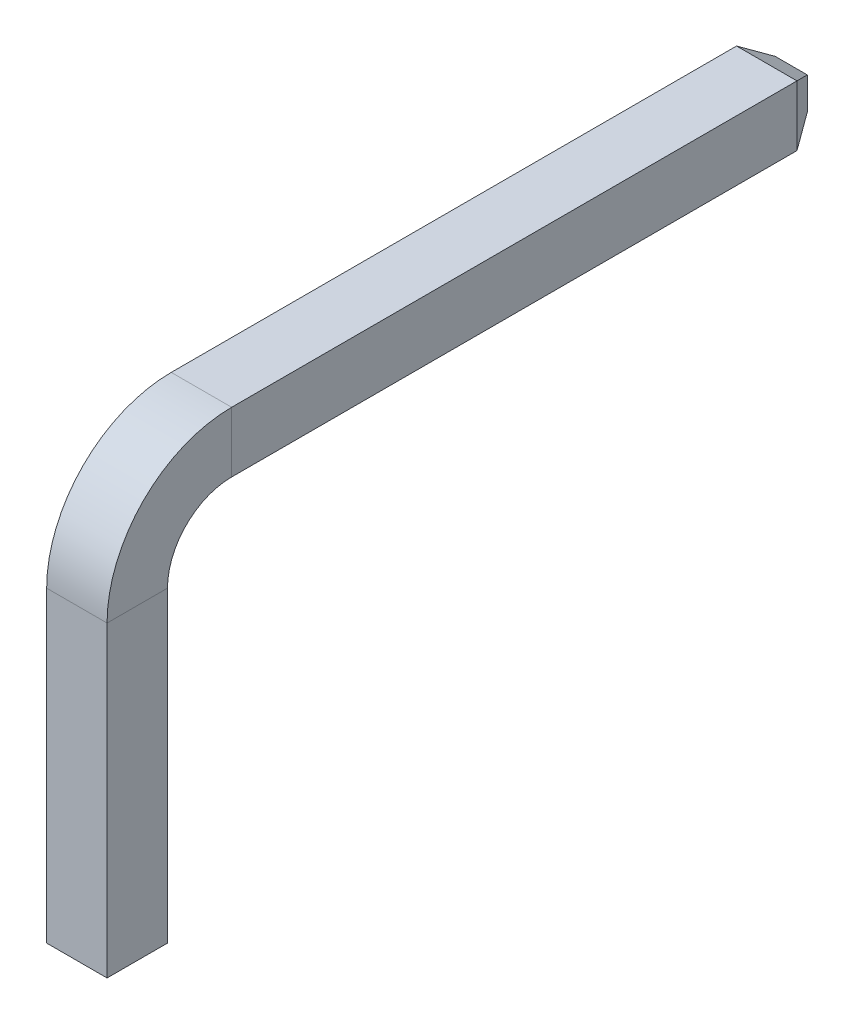
ISO-10303-21;
HEADER;
FILE_DESCRIPTION(('STEP AP214'),'2;1');
FILE_NAME('part.step','',(''),(''),'','','');
FILE_SCHEMA(('AUTOMOTIVE_DESIGN { 1 0 10303 214 1 1 1 1 }'));
ENDSEC;
DATA;
#1=APPLICATION_CONTEXT('core data for automotive mechanical design processes');
#2=APPLICATION_PROTOCOL_DEFINITION('international standard','automotive_design',2000,#1);
#3=PRODUCT_CONTEXT('',#1,'mechanical');
#4=PRODUCT('Part','Part','',(#3));
#5=PRODUCT_RELATED_PRODUCT_CATEGORY('part','',(#4));
#6=PRODUCT_DEFINITION_FORMATION('','',#4);
#7=PRODUCT_DEFINITION_CONTEXT('part definition',#1,'design');
#8=PRODUCT_DEFINITION('design','',#6,#7);
#9=PRODUCT_DEFINITION_SHAPE('','',#8);
#10=(LENGTH_UNIT() NAMED_UNIT(*) SI_UNIT(.MILLI.,.METRE.));
#11=(NAMED_UNIT(*) PLANE_ANGLE_UNIT() SI_UNIT($,.RADIAN.));
#12=(NAMED_UNIT(*) SI_UNIT($,.STERADIAN.) SOLID_ANGLE_UNIT());
#13=UNCERTAINTY_MEASURE_WITH_UNIT(LENGTH_MEASURE(1.E-05),#10,'distance_accuracy_value','');
#14=(GEOMETRIC_REPRESENTATION_CONTEXT(3) GLOBAL_UNCERTAINTY_ASSIGNED_CONTEXT((#13)) GLOBAL_UNIT_ASSIGNED_CONTEXT((#10,
#11,#12)) REPRESENTATION_CONTEXT('',''));
#15=CARTESIAN_POINT('',(0.,0.,0.));
#16=DIRECTION('',(0.,0.,1.));
#17=DIRECTION('',(1.,0.,0.));
#18=AXIS2_PLACEMENT_3D('',#15,#16,#17);
#19=CARTESIAN_POINT('',(0.,5.75,-7.25));
#20=DIRECTION('',(0.,0.,1.));
#21=DIRECTION('',(0.,-1.,0.));
#22=AXIS2_PLACEMENT_3D('',#19,#20,#21);
#23=PLANE('',#22);
#24=DIRECTION('',(0.,1.,0.));
#25=VECTOR('',#24,1.);
#26=CARTESIAN_POINT('',(-0.169999999999999,5.75,-7.25));
#27=LINE('',#26,#25);
#28=CARTESIAN_POINT('',(-0.169999999999999,5.58,-7.25));
#29=VERTEX_POINT('',#28);
#30=CARTESIAN_POINT('',(-0.169999999999999,5.92,-7.25));
#31=VERTEX_POINT('',#30);
#32=EDGE_CURVE('E149',#29,#31,#27,.T.);
#33=ORIENTED_EDGE('',*,*,#32,.T.);
#34=DIRECTION('',(1.,0.,0.));
#35=VECTOR('',#34,1.);
#36=CARTESIAN_POINT('',(0.,5.92,-7.25));
#37=LINE('',#36,#35);
#38=CARTESIAN_POINT('',(0.169999999999999,5.92,-7.25));
#39=VERTEX_POINT('',#38);
#40=EDGE_CURVE('E151',#31,#39,#37,.T.);
#41=ORIENTED_EDGE('',*,*,#40,.T.);
#42=DIRECTION('',(0.,-1.,0.));
#43=VECTOR('',#42,1.);
#44=CARTESIAN_POINT('',(0.169999999999999,5.75,-7.25));
#45=LINE('',#44,#43);
#46=CARTESIAN_POINT('',(0.169999999999999,5.58,-7.25));
#47=VERTEX_POINT('',#46);
#48=EDGE_CURVE('E131',#39,#47,#45,.T.);
#49=ORIENTED_EDGE('',*,*,#48,.T.);
#50=DIRECTION('',(-1.,0.,0.));
#51=VECTOR('',#50,1.);
#52=CARTESIAN_POINT('',(0.,5.58,-7.25));
#53=LINE('',#52,#51);
#54=EDGE_CURVE('E133',#47,#29,#53,.T.);
#55=ORIENTED_EDGE('',*,*,#54,.T.);
#56=EDGE_LOOP('',(#33,#41,#49,#55));
#57=FACE_BOUND('',#56,.T.);
#58=ADVANCED_FACE('F34',(#57),#23,.F.);
#59=CARTESIAN_POINT('',(0.32,6.07,-7.25));
#60=DIRECTION('',(-1.,0.,0.));
#61=DIRECTION('',(0.,0.,1.));
#62=AXIS2_PLACEMENT_3D('',#59,#60,#61);
#63=PLANE('',#62);
#64=DIRECTION('',(0.,0.,1.));
#65=VECTOR('',#64,1.);
#66=CARTESIAN_POINT('',(0.32,5.43,-7.25));
#67=LINE('',#66,#65);
#68=CARTESIAN_POINT('',(0.32,5.43,-6.99019237886467));
#69=VERTEX_POINT('',#68);
#70=CARTESIAN_POINT('',(0.32,5.43,-1.));
#71=VERTEX_POINT('',#70);
#72=EDGE_CURVE('E181',#69,#71,#67,.T.);
#73=ORIENTED_EDGE('',*,*,#72,.F.);
#74=DIRECTION('',(0.,1.,0.));
#75=VECTOR('',#74,1.);
#76=CARTESIAN_POINT('',(0.32,6.07,-6.99019237886467));
#77=LINE('',#76,#75);
#78=CARTESIAN_POINT('',(0.32,6.07,-6.99019237886467));
#79=VERTEX_POINT('',#78);
#80=EDGE_CURVE('E11',#69,#79,#77,.T.);
#81=ORIENTED_EDGE('',*,*,#80,.T.);
#82=DIRECTION('',(0.,0.,1.));
#83=VECTOR('',#82,1.);
#84=CARTESIAN_POINT('',(0.32,6.07,-7.25));
#85=LINE('',#84,#83);
#86=CARTESIAN_POINT('',(0.32,6.07,-1.));
#87=VERTEX_POINT('',#86);
#88=EDGE_CURVE('E170',#79,#87,#85,.T.);
#89=ORIENTED_EDGE('',*,*,#88,.T.);
#90=DIRECTION('',(0.,-1.,0.));
#91=VECTOR('',#90,1.);
#92=CARTESIAN_POINT('',(0.32,6.07,-1.));
#93=LINE('',#92,#91);
#94=EDGE_CURVE('E175',#87,#71,#93,.T.);
#95=ORIENTED_EDGE('',*,*,#94,.T.);
#96=EDGE_LOOP('',(#73,#81,#89,#95));
#97=FACE_BOUND('',#96,.T.);
#98=ADVANCED_FACE('F229',(#97),#63,.F.);
#99=CARTESIAN_POINT('',(-0.32,5.43,-7.25));
#100=DIRECTION('',(0.,1.,0.));
#101=DIRECTION('',(0.,0.,1.));
#102=AXIS2_PLACEMENT_3D('',#99,#100,#101);
#103=PLANE('',#102);
#104=DIRECTION('',(0.,0.,1.));
#105=VECTOR('',#104,1.);
#106=CARTESIAN_POINT('',(-0.32,5.43,-7.25));
#107=LINE('',#106,#105);
#108=CARTESIAN_POINT('',(-0.32,5.43,-6.99019237886467));
#109=VERTEX_POINT('',#108);
#110=CARTESIAN_POINT('',(-0.32,5.43,-1.));
#111=VERTEX_POINT('',#110);
#112=EDGE_CURVE('E200',#109,#111,#107,.T.);
#113=ORIENTED_EDGE('',*,*,#112,.F.);
#114=DIRECTION('',(1.,0.,0.));
#115=VECTOR('',#114,1.);
#116=CARTESIAN_POINT('',(-0.32,5.43,-6.99019237886467));
#117=LINE('',#116,#115);
#118=EDGE_CURVE('E43',#109,#69,#117,.T.);
#119=ORIENTED_EDGE('',*,*,#118,.T.);
#120=ORIENTED_EDGE('',*,*,#72,.T.);
#121=DIRECTION('',(-1.,0.,0.));
#122=VECTOR('',#121,1.);
#123=CARTESIAN_POINT('',(-0.32,5.43,-1.));
#124=LINE('',#123,#122);
#125=EDGE_CURVE('E197',#71,#111,#124,.T.);
#126=ORIENTED_EDGE('',*,*,#125,.T.);
#127=EDGE_LOOP('',(#113,#119,#120,#126));
#128=FACE_BOUND('',#127,.T.);
#129=ADVANCED_FACE('F224',(#128),#103,.F.);
#130=CARTESIAN_POINT('',(-0.32,6.07,-7.25));
#131=DIRECTION('',(1.,0.,0.));
#132=DIRECTION('',(0.,0.,-1.));
#133=AXIS2_PLACEMENT_3D('',#130,#131,#132);
#134=PLANE('',#133);
#135=DIRECTION('',(0.,0.,1.));
#136=VECTOR('',#135,1.);
#137=CARTESIAN_POINT('',(-0.32,6.07,-7.25));
#138=LINE('',#137,#136);
#139=CARTESIAN_POINT('',(-0.32,6.07,-6.99019237886467));
#140=VERTEX_POINT('',#139);
#141=CARTESIAN_POINT('',(-0.32,6.07,-1.));
#142=VERTEX_POINT('',#141);
#143=EDGE_CURVE('E145',#140,#142,#138,.T.);
#144=ORIENTED_EDGE('',*,*,#143,.F.);
#145=DIRECTION('',(0.,-1.,0.));
#146=VECTOR('',#145,1.);
#147=CARTESIAN_POINT('',(-0.32,6.07,-6.99019237886467));
#148=LINE('',#147,#146);
#149=EDGE_CURVE('E157',#140,#109,#148,.T.);
#150=ORIENTED_EDGE('',*,*,#149,.T.);
#151=ORIENTED_EDGE('',*,*,#112,.T.);
#152=DIRECTION('',(0.,1.,0.));
#153=VECTOR('',#152,1.);
#154=CARTESIAN_POINT('',(-0.32,6.07,-1.));
#155=LINE('',#154,#153);
#156=EDGE_CURVE('E202',#111,#142,#155,.T.);
#157=ORIENTED_EDGE('',*,*,#156,.T.);
#158=EDGE_LOOP('',(#144,#150,#151,#157));
#159=FACE_BOUND('',#158,.T.);
#160=ADVANCED_FACE('F340',(#159),#134,.F.);
#161=CARTESIAN_POINT('',(-0.32,6.07,-7.25));
#162=DIRECTION('',(0.,-1.,0.));
#163=DIRECTION('',(0.,0.,-1.));
#164=AXIS2_PLACEMENT_3D('',#161,#162,#163);
#165=PLANE('',#164);
#166=ORIENTED_EDGE('',*,*,#88,.F.);
#167=DIRECTION('',(-1.,0.,0.));
#168=VECTOR('',#167,1.);
#169=CARTESIAN_POINT('',(-0.32,6.07,-6.99019237886467));
#170=LINE('',#169,#168);
#171=EDGE_CURVE('E154',#79,#140,#170,.T.);
#172=ORIENTED_EDGE('',*,*,#171,.T.);
#173=ORIENTED_EDGE('',*,*,#143,.T.);
#174=DIRECTION('',(1.,0.,0.));
#175=VECTOR('',#174,1.);
#176=CARTESIAN_POINT('',(-0.32,6.07,-1.));
#177=LINE('',#176,#175);
#178=EDGE_CURVE('E141',#142,#87,#177,.T.);
#179=ORIENTED_EDGE('',*,*,#178,.T.);
#180=EDGE_LOOP('',(#166,#172,#173,#179));
#181=FACE_BOUND('',#180,.T.);
#182=ADVANCED_FACE('F333',(#181),#165,.F.);
#183=CARTESIAN_POINT('',(0.32,6.07,-1.));
#184=DIRECTION('',(-1.,0.,0.));
#185=DIRECTION('',(0.,0.,1.));
#186=AXIS2_PLACEMENT_3D('',#183,#184,#185);
#187=PLANE('',#186);
#188=CARTESIAN_POINT('',(0.32,4.75,-1.));
#189=DIRECTION('',(1.,0.,0.));
#190=DIRECTION('',(0.,1.,0.));
#191=AXIS2_PLACEMENT_3D('',#188,#189,#190);
#192=CIRCLE('',#191,0.68);
#193=CARTESIAN_POINT('',(0.32,4.75,-0.32));
#194=VERTEX_POINT('',#193);
#195=EDGE_CURVE('E188',#71,#194,#192,.T.);
#196=ORIENTED_EDGE('',*,*,#195,.F.);
#197=ORIENTED_EDGE('',*,*,#94,.F.);
#198=CARTESIAN_POINT('',(0.32,4.75,-1.));
#199=DIRECTION('',(1.,0.,0.));
#200=DIRECTION('',(0.,1.,0.));
#201=AXIS2_PLACEMENT_3D('',#198,#199,#200);
#202=CIRCLE('',#201,1.32);
#203=CARTESIAN_POINT('',(0.32,4.75,0.32));
#204=VERTEX_POINT('',#203);
#205=EDGE_CURVE('E144',#87,#204,#202,.T.);
#206=ORIENTED_EDGE('',*,*,#205,.T.);
#207=DIRECTION('',(0.,0.,-1.));
#208=VECTOR('',#207,1.);
#209=CARTESIAN_POINT('',(0.32,4.75,0.32));
#210=LINE('',#209,#208);
#211=EDGE_CURVE('E185',#204,#194,#210,.T.);
#212=ORIENTED_EDGE('',*,*,#211,.T.);
#213=EDGE_LOOP('',(#196,#197,#206,#212));
#214=FACE_BOUND('',#213,.T.);
#215=ADVANCED_FACE('F231',(#214),#187,.F.);
#216=CARTESIAN_POINT('',(0.,4.75,-1.));
#217=DIRECTION('',(1.,0.,0.));
#218=DIRECTION('',(0.,0.,-1.));
#219=AXIS2_PLACEMENT_3D('',#216,#217,#218);
#220=CYLINDRICAL_SURFACE('',#219,0.68);
#221=CARTESIAN_POINT('',(-0.32,4.75,-1.));
#222=DIRECTION('',(1.,0.,0.));
#223=DIRECTION('',(0.,1.,0.));
#224=AXIS2_PLACEMENT_3D('',#221,#222,#223);
#225=CIRCLE('',#224,0.68);
#226=CARTESIAN_POINT('',(-0.32,4.75,-0.32));
#227=VERTEX_POINT('',#226);
#228=EDGE_CURVE('E205',#111,#227,#225,.T.);
#229=ORIENTED_EDGE('',*,*,#228,.F.);
#230=ORIENTED_EDGE('',*,*,#125,.F.);
#231=ORIENTED_EDGE('',*,*,#195,.T.);
#232=DIRECTION('',(-1.,0.,0.));
#233=VECTOR('',#232,1.);
#234=CARTESIAN_POINT('',(-0.32,4.75,-0.32));
#235=LINE('',#234,#233);
#236=EDGE_CURVE('E191',#194,#227,#235,.T.);
#237=ORIENTED_EDGE('',*,*,#236,.T.);
#238=EDGE_LOOP('',(#229,#230,#231,#237));
#239=FACE_BOUND('',#238,.T.);
#240=ADVANCED_FACE('F227',(#239),#220,.F.);
#241=CARTESIAN_POINT('',(-0.32,6.07,-1.));
#242=DIRECTION('',(1.,0.,0.));
#243=DIRECTION('',(0.,0.,-1.));
#244=AXIS2_PLACEMENT_3D('',#241,#242,#243);
#245=PLANE('',#244);
#246=CARTESIAN_POINT('',(-0.32,4.75,-1.));
#247=DIRECTION('',(1.,0.,0.));
#248=DIRECTION('',(0.,1.,0.));
#249=AXIS2_PLACEMENT_3D('',#246,#247,#248);
#250=CIRCLE('',#249,1.32);
#251=CARTESIAN_POINT('',(-0.32,4.75,0.32));
#252=VERTEX_POINT('',#251);
#253=EDGE_CURVE('E139',#142,#252,#250,.T.);
#254=ORIENTED_EDGE('',*,*,#253,.F.);
#255=ORIENTED_EDGE('',*,*,#156,.F.);
#256=ORIENTED_EDGE('',*,*,#228,.T.);
#257=DIRECTION('',(0.,0.,1.));
#258=VECTOR('',#257,1.);
#259=CARTESIAN_POINT('',(-0.32,4.75,0.32));
#260=LINE('',#259,#258);
#261=EDGE_CURVE('E207',#227,#252,#260,.T.);
#262=ORIENTED_EDGE('',*,*,#261,.T.);
#263=EDGE_LOOP('',(#254,#255,#256,#262));
#264=FACE_BOUND('',#263,.T.);
#265=ADVANCED_FACE('F219',(#264),#245,.F.);
#266=CARTESIAN_POINT('',(0.,4.75,-1.));
#267=DIRECTION('',(1.,0.,0.));
#268=DIRECTION('',(0.,0.,-1.));
#269=AXIS2_PLACEMENT_3D('',#266,#267,#268);
#270=CYLINDRICAL_SURFACE('',#269,1.32);
#271=DIRECTION('',(1.,0.,0.));
#272=VECTOR('',#271,1.);
#273=CARTESIAN_POINT('',(-0.32,4.75,0.32));
#274=LINE('',#273,#272);
#275=EDGE_CURVE('E129',#252,#204,#274,.T.);
#276=ORIENTED_EDGE('',*,*,#275,.T.);
#277=ORIENTED_EDGE('',*,*,#205,.F.);
#278=ORIENTED_EDGE('',*,*,#178,.F.);
#279=ORIENTED_EDGE('',*,*,#253,.T.);
#280=EDGE_LOOP('',(#276,#277,#278,#279));
#281=FACE_BOUND('',#280,.T.);
#282=ADVANCED_FACE('F216',(#281),#270,.T.);
#283=CARTESIAN_POINT('',(0.32,4.75,0.32));
#284=DIRECTION('',(-1.,0.,0.));
#285=DIRECTION('',(0.,0.,1.));
#286=AXIS2_PLACEMENT_3D('',#283,#284,#285);
#287=PLANE('',#286);
#288=DIRECTION('',(0.,-1.,0.));
#289=VECTOR('',#288,1.);
#290=CARTESIAN_POINT('',(0.32,4.75,0.32));
#291=LINE('',#290,#289);
#292=CARTESIAN_POINT('',(0.32,1.49278538498976,0.32));
#293=VERTEX_POINT('',#292);
#294=EDGE_CURVE('E146',#204,#293,#291,.T.);
#295=ORIENTED_EDGE('',*,*,#294,.T.);
#296=DIRECTION('',(0.,0.,1.));
#297=VECTOR('',#296,1.);
#298=CARTESIAN_POINT('',(0.32,1.49278538498976,-7.25));
#299=LINE('',#298,#297);
#300=CARTESIAN_POINT('',(0.32,1.49278538498976,-0.32));
#301=VERTEX_POINT('',#300);
#302=EDGE_CURVE('E51',#301,#293,#299,.T.);
#303=ORIENTED_EDGE('',*,*,#302,.F.);
#304=DIRECTION('',(0.,-1.,0.));
#305=VECTOR('',#304,1.);
#306=CARTESIAN_POINT('',(0.32,4.75,-0.32));
#307=LINE('',#306,#305);
#308=EDGE_CURVE('E135',#194,#301,#307,.T.);
#309=ORIENTED_EDGE('',*,*,#308,.F.);
#310=ORIENTED_EDGE('',*,*,#211,.F.);
#311=EDGE_LOOP('',(#295,#303,#309,#310));
#312=FACE_BOUND('',#311,.T.);
#313=ADVANCED_FACE('F233',(#312),#287,.F.);
#314=CARTESIAN_POINT('',(-0.32,4.75,-0.32));
#315=DIRECTION('',(0.,0.,1.));
#316=DIRECTION('',(1.,0.,0.));
#317=AXIS2_PLACEMENT_3D('',#314,#315,#316);
#318=PLANE('',#317);
#319=ORIENTED_EDGE('',*,*,#308,.T.);
#320=DIRECTION('',(-1.,0.,0.));
#321=VECTOR('',#320,1.);
#322=CARTESIAN_POINT('',(-0.32,1.49278538498976,-0.32));
#323=LINE('',#322,#321);
#324=CARTESIAN_POINT('',(-0.32,1.49278538498976,-0.32));
#325=VERTEX_POINT('',#324);
#326=EDGE_CURVE('E125',#301,#325,#323,.T.);
#327=ORIENTED_EDGE('',*,*,#326,.T.);
#328=DIRECTION('',(0.,-1.,0.));
#329=VECTOR('',#328,1.);
#330=CARTESIAN_POINT('',(-0.32,4.75,-0.32));
#331=LINE('',#330,#329);
#332=EDGE_CURVE('E124',#227,#325,#331,.T.);
#333=ORIENTED_EDGE('',*,*,#332,.F.);
#334=ORIENTED_EDGE('',*,*,#236,.F.);
#335=EDGE_LOOP('',(#319,#327,#333,#334));
#336=FACE_BOUND('',#335,.T.);
#337=ADVANCED_FACE('F236',(#336),#318,.F.);
#338=CARTESIAN_POINT('',(-0.32,4.75,0.32));
#339=DIRECTION('',(1.,0.,0.));
#340=DIRECTION('',(0.,0.,-1.));
#341=AXIS2_PLACEMENT_3D('',#338,#339,#340);
#342=PLANE('',#341);
#343=ORIENTED_EDGE('',*,*,#332,.T.);
#344=DIRECTION('',(0.,0.,1.));
#345=VECTOR('',#344,1.);
#346=CARTESIAN_POINT('',(-0.32,1.49278538498976,-7.25));
#347=LINE('',#346,#345);
#348=CARTESIAN_POINT('',(-0.32,1.49278538498976,0.32));
#349=VERTEX_POINT('',#348);
#350=EDGE_CURVE('E112',#325,#349,#347,.T.);
#351=ORIENTED_EDGE('',*,*,#350,.T.);
#352=DIRECTION('',(0.,-1.,0.));
#353=VECTOR('',#352,1.);
#354=CARTESIAN_POINT('',(-0.32,4.75,0.32));
#355=LINE('',#354,#353);
#356=EDGE_CURVE('E122',#252,#349,#355,.T.);
#357=ORIENTED_EDGE('',*,*,#356,.F.);
#358=ORIENTED_EDGE('',*,*,#261,.F.);
#359=EDGE_LOOP('',(#343,#351,#357,#358));
#360=FACE_BOUND('',#359,.T.);
#361=ADVANCED_FACE('F120',(#360),#342,.F.);
#362=CARTESIAN_POINT('',(-0.32,4.75,0.32));
#363=DIRECTION('',(0.,0.,-1.));
#364=DIRECTION('',(-1.,0.,0.));
#365=AXIS2_PLACEMENT_3D('',#362,#363,#364);
#366=PLANE('',#365);
#367=ORIENTED_EDGE('',*,*,#356,.T.);
#368=DIRECTION('',(-1.,0.,0.));
#369=VECTOR('',#368,1.);
#370=CARTESIAN_POINT('',(-0.32,1.49278538498976,0.32));
#371=LINE('',#370,#369);
#372=EDGE_CURVE('E109',#293,#349,#371,.T.);
#373=ORIENTED_EDGE('',*,*,#372,.F.);
#374=ORIENTED_EDGE('',*,*,#294,.F.);
#375=ORIENTED_EDGE('',*,*,#275,.F.);
#376=EDGE_LOOP('',(#367,#373,#374,#375));
#377=FACE_BOUND('',#376,.T.);
#378=ADVANCED_FACE('F127',(#377),#366,.F.);
#379=CARTESIAN_POINT('',(0.,5.58,-7.25));
#380=DIRECTION('',(0.,0.866025403784436,0.500000000000005));
#381=DIRECTION('',(-1.,0.,0.));
#382=AXIS2_PLACEMENT_3D('',#379,#380,#381);
#383=PLANE('',#382);
#384=DIRECTION('',(-0.447213595499961,0.447213595499961,-0.77459666924148));
#385=VECTOR('',#384,1.);
#386=CARTESIAN_POINT('',(0.135999999999999,5.614,-7.30888972745734));
#387=LINE('',#386,#385);
#388=EDGE_CURVE('E163',#69,#47,#387,.T.);
#389=ORIENTED_EDGE('',*,*,#388,.F.);
#390=ORIENTED_EDGE('',*,*,#118,.F.);
#391=DIRECTION('',(0.447213595499961,0.447213595499961,-0.77459666924148));
#392=VECTOR('',#391,1.);
#393=CARTESIAN_POINT('',(-0.135999999999999,5.614,-7.30888972745734));
#394=LINE('',#393,#392);
#395=EDGE_CURVE('E38',#29,#109,#394,.F.);
#396=ORIENTED_EDGE('',*,*,#395,.F.);
#397=ORIENTED_EDGE('',*,*,#54,.F.);
#398=EDGE_LOOP('',(#389,#390,#396,#397));
#399=FACE_BOUND('',#398,.T.);
#400=ADVANCED_FACE('F36',(#399),#383,.F.);
#401=CARTESIAN_POINT('',(-0.169999999999999,5.75,-7.25));
#402=DIRECTION('',(0.866025403784436,0.,0.500000000000005));
#403=DIRECTION('',(0.,1.,0.));
#404=AXIS2_PLACEMENT_3D('',#401,#402,#403);
#405=PLANE('',#404);
#406=ORIENTED_EDGE('',*,*,#395,.T.);
#407=ORIENTED_EDGE('',*,*,#149,.F.);
#408=DIRECTION('',(0.447213595499961,-0.447213595499961,-0.77459666924148));
#409=VECTOR('',#408,1.);
#410=CARTESIAN_POINT('',(-0.135999999999999,5.886,-7.30888972745734));
#411=LINE('',#410,#409);
#412=EDGE_CURVE('E162',#31,#140,#411,.F.);
#413=ORIENTED_EDGE('',*,*,#412,.F.);
#414=ORIENTED_EDGE('',*,*,#32,.F.);
#415=EDGE_LOOP('',(#406,#407,#413,#414));
#416=FACE_BOUND('',#415,.T.);
#417=ADVANCED_FACE('F254',(#416),#405,.F.);
#418=CARTESIAN_POINT('',(0.169999999999999,5.75,-7.25));
#419=DIRECTION('',(-0.866025403784436,0.,0.500000000000005));
#420=DIRECTION('',(0.,-1.,0.));
#421=AXIS2_PLACEMENT_3D('',#418,#419,#420);
#422=PLANE('',#421);
#423=ORIENTED_EDGE('',*,*,#388,.T.);
#424=ORIENTED_EDGE('',*,*,#48,.F.);
#425=DIRECTION('',(0.447213595499961,0.447213595499961,0.77459666924148));
#426=VECTOR('',#425,1.);
#427=CARTESIAN_POINT('',(0.135999999999999,5.886,-7.30888972745734));
#428=LINE('',#427,#426);
#429=EDGE_CURVE('E160',#79,#39,#428,.F.);
#430=ORIENTED_EDGE('',*,*,#429,.F.);
#431=ORIENTED_EDGE('',*,*,#80,.F.);
#432=EDGE_LOOP('',(#423,#424,#430,#431));
#433=FACE_BOUND('',#432,.T.);
#434=ADVANCED_FACE('F265',(#433),#422,.F.);
#435=CARTESIAN_POINT('',(0.,5.92,-7.25));
#436=DIRECTION('',(0.,-0.866025403784436,0.500000000000005));
#437=DIRECTION('',(1.,0.,0.));
#438=AXIS2_PLACEMENT_3D('',#435,#436,#437);
#439=PLANE('',#438);
#440=ORIENTED_EDGE('',*,*,#412,.T.);
#441=ORIENTED_EDGE('',*,*,#171,.F.);
#442=ORIENTED_EDGE('',*,*,#429,.T.);
#443=ORIENTED_EDGE('',*,*,#40,.F.);
#444=EDGE_LOOP('',(#440,#441,#442,#443));
#445=FACE_BOUND('',#444,.T.);
#446=ADVANCED_FACE('F262',(#445),#439,.F.);
#447=CARTESIAN_POINT('',(-0.32,1.49278538498976,-7.25));
#448=DIRECTION('',(0.,1.,0.));
#449=DIRECTION('',(0.,0.,1.));
#450=AXIS2_PLACEMENT_3D('',#447,#448,#449);
#451=PLANE('',#450);
#452=ORIENTED_EDGE('',*,*,#302,.T.);
#453=ORIENTED_EDGE('',*,*,#372,.T.);
#454=ORIENTED_EDGE('',*,*,#350,.F.);
#455=ORIENTED_EDGE('',*,*,#326,.F.);
#456=EDGE_LOOP('',(#452,#453,#454,#455));
#457=FACE_BOUND('',#456,.T.);
#458=ADVANCED_FACE('F111',(#457),#451,.F.);
#459=CLOSED_SHELL('',(#58,#98,#129,#160,#182,#215,#240,#265,#282,#313,#337,#361,#378,#400,#417,
#434,#446,#458));
#460=MANIFOLD_SOLID_BREP('B2',#459);
#461=ADVANCED_BREP_SHAPE_REPRESENTATION('',(#18,#460),#14);
#462=SHAPE_DEFINITION_REPRESENTATION(#9,#461);
ENDSEC;
END-ISO-10303-21;
